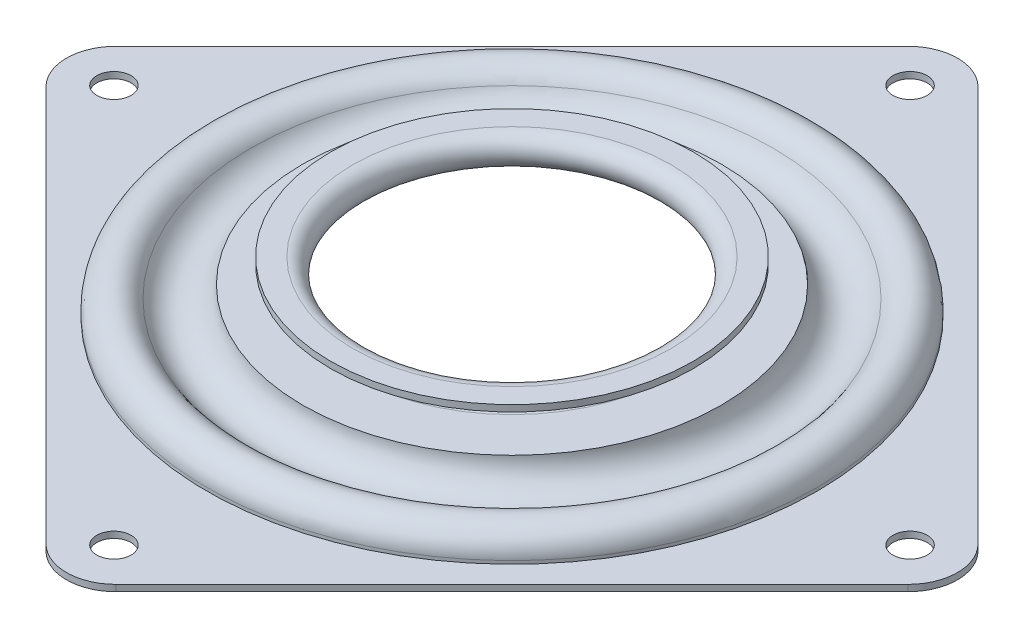
ISO-10303-21;
HEADER;
FILE_DESCRIPTION(('STEP AP214'),'2;1');
FILE_NAME('part.step','',(''),(''),'','','');
FILE_SCHEMA(('AUTOMOTIVE_DESIGN { 1 0 10303 214 1 1 1 1 }'));
ENDSEC;
DATA;
#1=APPLICATION_CONTEXT('core data for automotive mechanical design processes');
#2=APPLICATION_PROTOCOL_DEFINITION('international standard','automotive_design',2000,#1);
#3=PRODUCT_CONTEXT('',#1,'mechanical');
#4=PRODUCT('Part','Part','',(#3));
#5=PRODUCT_RELATED_PRODUCT_CATEGORY('part','',(#4));
#6=PRODUCT_DEFINITION_FORMATION('','',#4);
#7=PRODUCT_DEFINITION_CONTEXT('part definition',#1,'design');
#8=PRODUCT_DEFINITION('design','',#6,#7);
#9=PRODUCT_DEFINITION_SHAPE('','',#8);
#10=(LENGTH_UNIT() NAMED_UNIT(*) SI_UNIT(.MILLI.,.METRE.));
#11=(NAMED_UNIT(*) PLANE_ANGLE_UNIT() SI_UNIT($,.RADIAN.));
#12=(NAMED_UNIT(*) SI_UNIT($,.STERADIAN.) SOLID_ANGLE_UNIT());
#13=UNCERTAINTY_MEASURE_WITH_UNIT(LENGTH_MEASURE(1.E-05),#10,'distance_accuracy_value','');
#14=(GEOMETRIC_REPRESENTATION_CONTEXT(3) GLOBAL_UNCERTAINTY_ASSIGNED_CONTEXT((#13)) GLOBAL_UNIT_ASSIGNED_CONTEXT((#10,
#11,#12)) REPRESENTATION_CONTEXT('',''));
#15=CARTESIAN_POINT('',(0.,0.,0.));
#16=DIRECTION('',(0.,0.,1.));
#17=DIRECTION('',(1.,0.,0.));
#18=AXIS2_PLACEMENT_3D('',#15,#16,#17);
#19=CARTESIAN_POINT('',(18.40865,1.94055999999999,0.));
#20=DIRECTION('',(0.,1.,0.));
#21=DIRECTION('',(-1.,0.,0.));
#22=AXIS2_PLACEMENT_3D('',#19,#20,#21);
#23=PLANE('',#22);
#24=CARTESIAN_POINT('',(0.,1.94055999999999,0.));
#25=DIRECTION('',(0.,1.,0.));
#26=DIRECTION('',(-1.,0.,0.));
#27=AXIS2_PLACEMENT_3D('',#24,#25,#26);
#28=CIRCLE('',#27,20.9683035022425);
#29=CARTESIAN_POINT('',(-20.9683035022425,1.94055999999998,0.));
#30=VERTEX_POINT('',#29);
#31=EDGE_CURVE('E158',#30,#30,#28,.T.);
#32=ORIENTED_EDGE('',*,*,#31,.F.);
#33=EDGE_LOOP('',(#32));
#34=FACE_BOUND('',#33,.T.);
#35=CARTESIAN_POINT('',(0.,1.94055999999999,0.));
#36=DIRECTION('',(0.,1.,0.));
#37=DIRECTION('',(-1.,0.,0.));
#38=AXIS2_PLACEMENT_3D('',#35,#36,#37);
#39=CIRCLE('',#38,18.40865);
#40=CARTESIAN_POINT('',(-18.40865,1.94055999999998,0.));
#41=VERTEX_POINT('',#40);
#42=EDGE_CURVE('E123',#41,#41,#39,.T.);
#43=ORIENTED_EDGE('',*,*,#42,.T.);
#44=EDGE_LOOP('',(#43));
#45=FACE_BOUND('',#44,.T.);
#46=ADVANCED_FACE('F33',(#34,#45),#23,.F.);
#47=CARTESIAN_POINT('',(0.,0.905509999999988,0.));
#48=DIRECTION('',(0.,1.,0.));
#49=DIRECTION('',(-1.,0.,0.));
#50=AXIS2_PLACEMENT_3D('',#47,#48,#49);
#51=TOROIDAL_SURFACE('',#50,18.40865,1.03505);
#52=ORIENTED_EDGE('',*,*,#42,.F.);
#53=EDGE_LOOP('',(#52));
#54=FACE_BOUND('',#53,.T.);
#55=CARTESIAN_POINT('',(0.,-0.129540000000012,0.));
#56=DIRECTION('',(0.,1.,0.));
#57=DIRECTION('',(-1.,0.,0.));
#58=AXIS2_PLACEMENT_3D('',#55,#56,#57);
#59=CIRCLE('',#58,18.40865);
#60=CARTESIAN_POINT('',(-18.40865,-0.129540000000018,0.));
#61=VERTEX_POINT('',#60);
#62=EDGE_CURVE('E127',#61,#61,#59,.T.);
#63=ORIENTED_EDGE('',*,*,#62,.T.);
#64=EDGE_LOOP('',(#63));
#65=FACE_BOUND('',#64,.T.);
#66=ADVANCED_FACE('F208',(#54,#65),#51,.F.);
#67=CARTESIAN_POINT('',(23.5279570044849,-0.129540000000006,0.));
#68=DIRECTION('',(0.,-1.,0.));
#69=DIRECTION('',(1.,0.,0.));
#70=AXIS2_PLACEMENT_3D('',#67,#68,#69);
#71=PLANE('',#70);
#72=ORIENTED_EDGE('',*,*,#62,.F.);
#73=EDGE_LOOP('',(#72));
#74=FACE_BOUND('',#73,.T.);
#75=CARTESIAN_POINT('',(0.,-0.129540000000015,0.));
#76=DIRECTION('',(0.,1.,0.));
#77=DIRECTION('',(-1.,0.,0.));
#78=AXIS2_PLACEMENT_3D('',#75,#76,#77);
#79=CIRCLE('',#78,24.1707227175114);
#80=CARTESIAN_POINT('',(-24.1707227175114,-0.129540000000022,0.));
#81=VERTEX_POINT('',#80);
#82=EDGE_CURVE('E203',#81,#81,#79,.T.);
#83=ORIENTED_EDGE('',*,*,#82,.T.);
#84=EDGE_LOOP('',(#83));
#85=FACE_BOUND('',#84,.T.);
#86=ADVANCED_FACE('F210',(#74,#85),#71,.F.);
#87=CARTESIAN_POINT('',(0.,0.,0.));
#88=DIRECTION('',(0.,1.,0.));
#89=DIRECTION('',(-1.,0.,0.));
#90=AXIS2_PLACEMENT_3D('',#87,#88,#89);
#91=TOROIDAL_SURFACE('',#90,27.3685,3.20040000000001);
#92=ORIENTED_EDGE('',*,*,#82,.F.);
#93=EDGE_LOOP('',(#92));
#94=FACE_BOUND('',#93,.T.);
#95=CARTESIAN_POINT('',(0.,-1.53619200000002,0.));
#96=DIRECTION('',(0.,1.,0.));
#97=DIRECTION('',(-1.,0.,0.));
#98=AXIS2_PLACEMENT_3D('',#95,#96,#97);
#99=CIRCLE('',#98,30.1761100689262);
#100=CARTESIAN_POINT('',(-30.1761100689262,-1.53619200000003,0.));
#101=VERTEX_POINT('',#100);
#102=EDGE_CURVE('E200',#101,#101,#99,.T.);
#103=ORIENTED_EDGE('',*,*,#102,.T.);
#104=EDGE_LOOP('',(#103));
#105=FACE_BOUND('',#104,.T.);
#106=ADVANCED_FACE('F213',(#94,#105),#91,.F.);
#107=CARTESIAN_POINT('',(0.,-2.83464000000002,0.));
#108=DIRECTION('',(0.,1.,0.));
#109=DIRECTION('',(-1.,0.,0.));
#110=AXIS2_PLACEMENT_3D('',#107,#108,#109);
#111=TOROIDAL_SURFACE('',#110,32.5492090557568,2.70510000000001);
#112=ORIENTED_EDGE('',*,*,#102,.F.);
#113=EDGE_LOOP('',(#112));
#114=FACE_BOUND('',#113,.T.);
#115=CARTESIAN_POINT('',(0.,-2.83464000000002,0.));
#116=DIRECTION('',(0.,1.,0.));
#117=DIRECTION('',(-1.,0.,0.));
#118=AXIS2_PLACEMENT_3D('',#115,#116,#117);
#119=CIRCLE('',#118,35.2543090557568);
#120=CARTESIAN_POINT('',(-35.2543090557568,-2.83464000000003,0.));
#121=VERTEX_POINT('',#120);
#122=EDGE_CURVE('E197',#121,#121,#119,.T.);
#123=ORIENTED_EDGE('',*,*,#122,.T.);
#124=EDGE_LOOP('',(#123));
#125=FACE_BOUND('',#124,.T.);
#126=ADVANCED_FACE('F219',(#114,#125),#111,.T.);
#127=CARTESIAN_POINT('',(0.,3.93699999999999,0.));
#128=DIRECTION('',(0.,1.,0.));
#129=DIRECTION('',(-1.,0.,0.));
#130=AXIS2_PLACEMENT_3D('',#127,#128,#129);
#131=CYLINDRICAL_SURFACE('',#130,35.2543090557568);
#132=ORIENTED_EDGE('',*,*,#122,.F.);
#133=EDGE_LOOP('',(#132));
#134=FACE_BOUND('',#133,.T.);
#135=CARTESIAN_POINT('',(0.,-3.20040000000002,0.));
#136=DIRECTION('',(0.,1.,0.));
#137=DIRECTION('',(-1.,0.,0.));
#138=AXIS2_PLACEMENT_3D('',#135,#136,#137);
#139=CIRCLE('',#138,35.2543090557568);
#140=CARTESIAN_POINT('',(-35.2543090557568,-3.20040000000003,0.));
#141=VERTEX_POINT('',#140);
#142=EDGE_CURVE('E194',#141,#141,#139,.T.);
#143=ORIENTED_EDGE('',*,*,#142,.T.);
#144=EDGE_LOOP('',(#143));
#145=FACE_BOUND('',#144,.T.);
#146=ADVANCED_FACE('F225',(#134,#145),#131,.T.);
#147=CARTESIAN_POINT('',(38.1,-3.2004,0.));
#148=DIRECTION('',(0.,-1.,0.));
#149=DIRECTION('',(1.,0.,0.));
#150=AXIS2_PLACEMENT_3D('',#147,#148,#149);
#151=PLANE('',#150);
#152=CARTESIAN_POINT('',(46.0238126204794,-3.2004,0.));
#153=DIRECTION('',(0.,-1.,0.));
#154=DIRECTION('',(1.,0.,0.));
#155=AXIS2_PLACEMENT_3D('',#152,#153,#154);
#156=CIRCLE('',#155,1.984375);
#157=CARTESIAN_POINT('',(48.0081876204794,-3.2004,0.));
#158=VERTEX_POINT('',#157);
#159=EDGE_CURVE('E167',#158,#158,#156,.T.);
#160=ORIENTED_EDGE('',*,*,#159,.T.);
#161=EDGE_LOOP('',(#160));
#162=FACE_BOUND('',#161,.T.);
#163=CARTESIAN_POINT('',(0.,-3.20040000000001,-46.0238126204794));
#164=DIRECTION('',(0.,-1.,0.));
#165=DIRECTION('',(1.,0.,0.));
#166=AXIS2_PLACEMENT_3D('',#163,#164,#165);
#167=CIRCLE('',#166,1.984375);
#168=CARTESIAN_POINT('',(1.98437499999998,-3.20040000000001,-46.0238126204794));
#169=VERTEX_POINT('',#168);
#170=EDGE_CURVE('E363',#169,#169,#167,.T.);
#171=ORIENTED_EDGE('',*,*,#170,.T.);
#172=EDGE_LOOP('',(#171));
#173=FACE_BOUND('',#172,.T.);
#174=CARTESIAN_POINT('',(-46.0238126204794,-3.20040000000003,0.));
#175=DIRECTION('',(0.,-1.,0.));
#176=DIRECTION('',(1.,0.,0.));
#177=AXIS2_PLACEMENT_3D('',#174,#175,#176);
#178=CIRCLE('',#177,1.984375);
#179=CARTESIAN_POINT('',(-44.0394376204794,-3.20040000000003,0.));
#180=VERTEX_POINT('',#179);
#181=EDGE_CURVE('E360',#180,#180,#178,.T.);
#182=ORIENTED_EDGE('',*,*,#181,.T.);
#183=EDGE_LOOP('',(#182));
#184=FACE_BOUND('',#183,.T.);
#185=CARTESIAN_POINT('',(0.,-3.20040000000001,46.0238126204794));
#186=DIRECTION('',(0.,-1.,0.));
#187=DIRECTION('',(1.,0.,0.));
#188=AXIS2_PLACEMENT_3D('',#185,#186,#187);
#189=CIRCLE('',#188,1.984375);
#190=CARTESIAN_POINT('',(1.98437500000001,-3.20040000000001,46.0238126204794));
#191=VERTEX_POINT('',#190);
#192=EDGE_CURVE('E357',#191,#191,#189,.T.);
#193=ORIENTED_EDGE('',*,*,#192,.T.);
#194=EDGE_LOOP('',(#193));
#195=FACE_BOUND('',#194,.T.);
#196=ORIENTED_EDGE('',*,*,#142,.F.);
#197=EDGE_LOOP('',(#196));
#198=FACE_BOUND('',#197,.T.);
#199=DIRECTION('',(0.707106781186548,0.,-0.707106781186548));
#200=VECTOR('',#199,1.);
#201=CARTESIAN_POINT('',(0.,-3.2004,-53.8815367264149));
#202=LINE('',#201,#200);
#203=CARTESIAN_POINT('',(-49.8404214719338,-3.20040000000001,-4.04111525448109));
#204=VERTEX_POINT('',#203);
#205=CARTESIAN_POINT('',(-4.0411152544811,-3.2004,-49.8404214719338));
#206=VERTEX_POINT('',#205);
#207=EDGE_CURVE('E119',#204,#206,#202,.T.);
#208=ORIENTED_EDGE('',*,*,#207,.F.);
#209=CARTESIAN_POINT('',(-45.7993062174527,-3.20040000000003,0.));
#210=DIRECTION('',(0.,-1.,0.));
#211=DIRECTION('',(1.,0.,0.));
#212=AXIS2_PLACEMENT_3D('',#209,#210,#211);
#213=CIRCLE('',#212,5.715);
#214=CARTESIAN_POINT('',(-49.8404214719338,-3.20040000000001,4.04111525448111));
#215=VERTEX_POINT('',#214);
#216=EDGE_CURVE('E145',#204,#215,#213,.F.);
#217=ORIENTED_EDGE('',*,*,#216,.T.);
#218=DIRECTION('',(-0.707106781186548,0.,-0.707106781186548));
#219=VECTOR('',#218,1.);
#220=CARTESIAN_POINT('',(-53.8815367264149,-3.20040000000001,0.));
#221=LINE('',#220,#219);
#222=CARTESIAN_POINT('',(-4.04111525448108,-3.2004,49.8404214719338));
#223=VERTEX_POINT('',#222);
#224=EDGE_CURVE('E155',#223,#215,#221,.T.);
#225=ORIENTED_EDGE('',*,*,#224,.F.);
#226=CARTESIAN_POINT('',(0.,-3.20040000000001,45.7993062174527));
#227=DIRECTION('',(0.,-1.,0.));
#228=DIRECTION('',(1.,0.,0.));
#229=AXIS2_PLACEMENT_3D('',#226,#227,#228);
#230=CIRCLE('',#229,5.715);
#231=CARTESIAN_POINT('',(4.04111525448115,-3.20039999999999,49.8404214719338));
#232=VERTEX_POINT('',#231);
#233=EDGE_CURVE('E122',#223,#232,#230,.F.);
#234=ORIENTED_EDGE('',*,*,#233,.T.);
#235=DIRECTION('',(-0.707106781186548,0.,0.707106781186548));
#236=VECTOR('',#235,1.);
#237=CARTESIAN_POINT('',(0.,-3.2004,53.8815367264149));
#238=LINE('',#237,#236);
#239=CARTESIAN_POINT('',(49.8404214719339,-3.20039999999998,4.04111525448109));
#240=VERTEX_POINT('',#239);
#241=EDGE_CURVE('E154',#240,#232,#238,.T.);
#242=ORIENTED_EDGE('',*,*,#241,.F.);
#243=CARTESIAN_POINT('',(45.7993062174527,-3.2004,0.));
#244=DIRECTION('',(0.,-1.,0.));
#245=DIRECTION('',(1.,0.,0.));
#246=AXIS2_PLACEMENT_3D('',#243,#244,#245);
#247=CIRCLE('',#246,5.715);
#248=CARTESIAN_POINT('',(49.8404214719338,-3.20039999999998,-4.04111525448113));
#249=VERTEX_POINT('',#248);
#250=EDGE_CURVE('E48',#240,#249,#247,.F.);
#251=ORIENTED_EDGE('',*,*,#250,.T.);
#252=DIRECTION('',(0.707106781186548,0.,0.707106781186547));
#253=VECTOR('',#252,1.);
#254=CARTESIAN_POINT('',(53.881536726415,-3.20039999999998,0.));
#255=LINE('',#254,#253);
#256=CARTESIAN_POINT('',(4.04111525448113,-3.20039999999999,-49.8404214719338));
#257=VERTEX_POINT('',#256);
#258=EDGE_CURVE('E156',#257,#249,#255,.T.);
#259=ORIENTED_EDGE('',*,*,#258,.F.);
#260=CARTESIAN_POINT('',(0.,-3.20040000000001,-45.7993062174527));
#261=DIRECTION('',(0.,-1.,0.));
#262=DIRECTION('',(1.,0.,0.));
#263=AXIS2_PLACEMENT_3D('',#260,#261,#262);
#264=CIRCLE('',#263,5.715);
#265=EDGE_CURVE('E143',#257,#206,#264,.F.);
#266=ORIENTED_EDGE('',*,*,#265,.T.);
#267=EDGE_LOOP('',(#208,#217,#225,#234,#242,#251,#259,#266));
#268=FACE_BOUND('',#267,.T.);
#269=ADVANCED_FACE('F231',(#162,#173,#184,#195,#198,#268),#151,.F.);
#270=CARTESIAN_POINT('',(38.1,-3.937,0.));
#271=DIRECTION('',(0.,-1.,0.));
#272=DIRECTION('',(1.,0.,0.));
#273=AXIS2_PLACEMENT_3D('',#270,#271,#272);
#274=PLANE('',#273);
#275=CARTESIAN_POINT('',(46.0238126204794,-3.93700000000003,0.));
#276=DIRECTION('',(0.,1.,0.));
#277=DIRECTION('',(0.,0.,1.));
#278=AXIS2_PLACEMENT_3D('',#275,#276,#277);
#279=CIRCLE('',#278,1.984375);
#280=CARTESIAN_POINT('',(46.0238126204794,-3.93700000000003,1.98437499999999));
#281=VERTEX_POINT('',#280);
#282=EDGE_CURVE('E338',#281,#281,#279,.T.);
#283=ORIENTED_EDGE('',*,*,#282,.T.);
#284=EDGE_LOOP('',(#283));
#285=FACE_BOUND('',#284,.T.);
#286=CARTESIAN_POINT('',(0.,-3.93700000000003,-46.0238126204794));
#287=DIRECTION('',(0.,1.,0.));
#288=DIRECTION('',(0.,0.,1.));
#289=AXIS2_PLACEMENT_3D('',#286,#287,#288);
#290=CIRCLE('',#289,1.984375);
#291=CARTESIAN_POINT('',(0.,-3.93700000000003,-44.0394376204794));
#292=VERTEX_POINT('',#291);
#293=EDGE_CURVE('E342',#292,#292,#290,.T.);
#294=ORIENTED_EDGE('',*,*,#293,.T.);
#295=EDGE_LOOP('',(#294));
#296=FACE_BOUND('',#295,.T.);
#297=CARTESIAN_POINT('',(-46.0238126204794,-3.93700000000003,0.));
#298=DIRECTION('',(0.,1.,0.));
#299=DIRECTION('',(0.,0.,1.));
#300=AXIS2_PLACEMENT_3D('',#297,#298,#299);
#301=CIRCLE('',#300,1.984375);
#302=CARTESIAN_POINT('',(-46.0238126204794,-3.93700000000003,1.98437500000001));
#303=VERTEX_POINT('',#302);
#304=EDGE_CURVE('E346',#303,#303,#301,.T.);
#305=ORIENTED_EDGE('',*,*,#304,.T.);
#306=EDGE_LOOP('',(#305));
#307=FACE_BOUND('',#306,.T.);
#308=CARTESIAN_POINT('',(0.,-3.93700000000003,46.0238126204794));
#309=DIRECTION('',(0.,1.,0.));
#310=DIRECTION('',(0.,0.,1.));
#311=AXIS2_PLACEMENT_3D('',#308,#309,#310);
#312=CIRCLE('',#311,1.984375);
#313=CARTESIAN_POINT('',(0.,-3.93700000000003,48.0081876204794));
#314=VERTEX_POINT('',#313);
#315=EDGE_CURVE('E350',#314,#314,#312,.T.);
#316=ORIENTED_EDGE('',*,*,#315,.T.);
#317=EDGE_LOOP('',(#316));
#318=FACE_BOUND('',#317,.T.);
#319=CARTESIAN_POINT('',(0.,-3.93700000000002,0.));
#320=DIRECTION('',(0.,1.,0.));
#321=DIRECTION('',(-1.,0.,0.));
#322=AXIS2_PLACEMENT_3D('',#319,#320,#321);
#323=CIRCLE('',#322,34.5177090557568);
#324=CARTESIAN_POINT('',(-34.5177090557568,-3.93700000000003,0.));
#325=VERTEX_POINT('',#324);
#326=EDGE_CURVE('E191',#325,#325,#323,.T.);
#327=ORIENTED_EDGE('',*,*,#326,.T.);
#328=EDGE_LOOP('',(#327));
#329=FACE_BOUND('',#328,.T.);
#330=DIRECTION('',(-0.707106781186548,0.,-0.707106781186548));
#331=VECTOR('',#330,1.);
#332=CARTESIAN_POINT('',(-53.8815367264149,-3.93700000000003,0.));
#333=LINE('',#332,#331);
#334=CARTESIAN_POINT('',(-4.04111525448108,-3.93700000000001,49.8404214719338));
#335=VERTEX_POINT('',#334);
#336=CARTESIAN_POINT('',(-49.8404214719338,-3.93700000000003,4.04111525448111));
#337=VERTEX_POINT('',#336);
#338=EDGE_CURVE('E102',#335,#337,#333,.T.);
#339=ORIENTED_EDGE('',*,*,#338,.T.);
#340=CARTESIAN_POINT('',(-45.7993062174527,-3.93700000000003,0.));
#341=DIRECTION('',(0.,-1.,0.));
#342=DIRECTION('',(1.,0.,0.));
#343=AXIS2_PLACEMENT_3D('',#340,#341,#342);
#344=CIRCLE('',#343,5.715);
#345=CARTESIAN_POINT('',(-49.8404214719338,-3.93700000000003,-4.04111525448109));
#346=VERTEX_POINT('',#345);
#347=EDGE_CURVE('E134',#337,#346,#344,.T.);
#348=ORIENTED_EDGE('',*,*,#347,.T.);
#349=DIRECTION('',(0.707106781186548,0.,-0.707106781186548));
#350=VECTOR('',#349,1.);
#351=CARTESIAN_POINT('',(0.,-3.93700000000001,-53.8815367264149));
#352=LINE('',#351,#350);
#353=CARTESIAN_POINT('',(-4.0411152544811,-3.93700000000001,-49.8404214719338));
#354=VERTEX_POINT('',#353);
#355=EDGE_CURVE('E163',#346,#354,#352,.T.);
#356=ORIENTED_EDGE('',*,*,#355,.T.);
#357=CARTESIAN_POINT('',(0.,-3.93700000000001,-45.7993062174527));
#358=DIRECTION('',(0.,-1.,0.));
#359=DIRECTION('',(1.,0.,0.));
#360=AXIS2_PLACEMENT_3D('',#357,#358,#359);
#361=CIRCLE('',#360,5.715);
#362=CARTESIAN_POINT('',(4.04111525448113,-3.93700000000001,-49.8404214719338));
#363=VERTEX_POINT('',#362);
#364=EDGE_CURVE('E132',#354,#363,#361,.T.);
#365=ORIENTED_EDGE('',*,*,#364,.T.);
#366=DIRECTION('',(0.707106781186548,0.,0.707106781186547));
#367=VECTOR('',#366,1.);
#368=CARTESIAN_POINT('',(53.881536726415,-3.937,0.));
#369=LINE('',#368,#367);
#370=CARTESIAN_POINT('',(49.8404214719338,-3.937,-4.04111525448113));
#371=VERTEX_POINT('',#370);
#372=EDGE_CURVE('E166',#363,#371,#369,.T.);
#373=ORIENTED_EDGE('',*,*,#372,.T.);
#374=CARTESIAN_POINT('',(45.7993062174527,-3.937,0.));
#375=DIRECTION('',(0.,-1.,0.));
#376=DIRECTION('',(1.,0.,0.));
#377=AXIS2_PLACEMENT_3D('',#374,#375,#376);
#378=CIRCLE('',#377,5.715);
#379=CARTESIAN_POINT('',(49.8404214719339,-3.937,4.04111525448109));
#380=VERTEX_POINT('',#379);
#381=EDGE_CURVE('E109',#371,#380,#378,.T.);
#382=ORIENTED_EDGE('',*,*,#381,.T.);
#383=DIRECTION('',(-0.707106781186548,0.,0.707106781186548));
#384=VECTOR('',#383,1.);
#385=CARTESIAN_POINT('',(0.,-3.93700000000001,53.8815367264149));
#386=LINE('',#385,#384);
#387=CARTESIAN_POINT('',(4.04111525448115,-3.93700000000001,49.8404214719338));
#388=VERTEX_POINT('',#387);
#389=EDGE_CURVE('E104',#380,#388,#386,.T.);
#390=ORIENTED_EDGE('',*,*,#389,.T.);
#391=CARTESIAN_POINT('',(0.,-3.93700000000001,45.7993062174527));
#392=DIRECTION('',(0.,-1.,0.));
#393=DIRECTION('',(1.,0.,0.));
#394=AXIS2_PLACEMENT_3D('',#391,#392,#393);
#395=CIRCLE('',#394,5.715);
#396=EDGE_CURVE('E99',#388,#335,#395,.T.);
#397=ORIENTED_EDGE('',*,*,#396,.T.);
#398=EDGE_LOOP('',(#339,#348,#356,#365,#373,#382,#390,#397));
#399=FACE_BOUND('',#398,.T.);
#400=ADVANCED_FACE('F101',(#285,#296,#307,#318,#329,#399),#274,.T.);
#401=CARTESIAN_POINT('',(0.,3.93699999999999,0.));
#402=DIRECTION('',(0.,1.,0.));
#403=DIRECTION('',(-1.,0.,0.));
#404=AXIS2_PLACEMENT_3D('',#401,#402,#403);
#405=CYLINDRICAL_SURFACE('',#404,34.5177090557568);
#406=CARTESIAN_POINT('',(0.,-2.83464000000002,0.));
#407=DIRECTION('',(0.,1.,0.));
#408=DIRECTION('',(-1.,0.,0.));
#409=AXIS2_PLACEMENT_3D('',#406,#407,#408);
#410=CIRCLE('',#409,34.5177090557568);
#411=CARTESIAN_POINT('',(-34.5177090557568,-2.83464000000003,0.));
#412=VERTEX_POINT('',#411);
#413=EDGE_CURVE('E188',#412,#412,#410,.T.);
#414=ORIENTED_EDGE('',*,*,#413,.T.);
#415=EDGE_LOOP('',(#414));
#416=FACE_BOUND('',#415,.T.);
#417=ORIENTED_EDGE('',*,*,#326,.F.);
#418=EDGE_LOOP('',(#417));
#419=FACE_BOUND('',#418,.T.);
#420=ADVANCED_FACE('F327',(#416,#419),#405,.F.);
#421=CARTESIAN_POINT('',(0.,-2.83464000000002,0.));
#422=DIRECTION('',(0.,1.,0.));
#423=DIRECTION('',(-1.,0.,0.));
#424=AXIS2_PLACEMENT_3D('',#421,#422,#423);
#425=TOROIDAL_SURFACE('',#424,32.5492090557568,1.96850000000001);
#426=CARTESIAN_POINT('',(0.,-1.88976000000002,0.));
#427=DIRECTION('',(0.,1.,0.));
#428=DIRECTION('',(-1.,0.,0.));
#429=AXIS2_PLACEMENT_3D('',#426,#427,#428);
#430=CIRCLE('',#429,30.8223060371712);
#431=CARTESIAN_POINT('',(-30.8223060371712,-1.88976000000003,0.));
#432=VERTEX_POINT('',#431);
#433=EDGE_CURVE('E185',#432,#432,#430,.T.);
#434=ORIENTED_EDGE('',*,*,#433,.T.);
#435=EDGE_LOOP('',(#434));
#436=FACE_BOUND('',#435,.T.);
#437=ORIENTED_EDGE('',*,*,#413,.F.);
#438=EDGE_LOOP('',(#437));
#439=FACE_BOUND('',#438,.T.);
#440=ADVANCED_FACE('F323',(#436,#439),#425,.F.);
#441=CARTESIAN_POINT('',(0.,0.,0.));
#442=DIRECTION('',(0.,1.,0.));
#443=DIRECTION('',(-1.,0.,0.));
#444=AXIS2_PLACEMENT_3D('',#441,#442,#443);
#445=TOROIDAL_SURFACE('',#444,27.3685,3.93700000000001);
#446=CARTESIAN_POINT('',(0.,-0.866140000000013,0.));
#447=DIRECTION('',(0.,1.,0.));
#448=DIRECTION('',(-1.,0.,0.));
#449=AXIS2_PLACEMENT_3D('',#446,#447,#448);
#450=CIRCLE('',#449,23.5279570044849);
#451=CARTESIAN_POINT('',(-23.5279570044849,-0.866140000000021,0.));
#452=VERTEX_POINT('',#451);
#453=EDGE_CURVE('E182',#452,#452,#450,.T.);
#454=ORIENTED_EDGE('',*,*,#453,.T.);
#455=EDGE_LOOP('',(#454));
#456=FACE_BOUND('',#455,.T.);
#457=ORIENTED_EDGE('',*,*,#433,.F.);
#458=EDGE_LOOP('',(#457));
#459=FACE_BOUND('',#458,.T.);
#460=ADVANCED_FACE('F319',(#456,#459),#445,.T.);
#461=CARTESIAN_POINT('',(23.5279570044849,-0.866140000000006,0.));
#462=DIRECTION('',(0.,-1.,0.));
#463=DIRECTION('',(1.,0.,0.));
#464=AXIS2_PLACEMENT_3D('',#461,#462,#463);
#465=PLANE('',#464);
#466=CARTESIAN_POINT('',(0.,-0.866140000000012,0.));
#467=DIRECTION('',(0.,1.,0.));
#468=DIRECTION('',(-1.,0.,0.));
#469=AXIS2_PLACEMENT_3D('',#466,#467,#468);
#470=CIRCLE('',#469,18.40865);
#471=CARTESIAN_POINT('',(-18.40865,-0.866140000000017,0.));
#472=VERTEX_POINT('',#471);
#473=EDGE_CURVE('E179',#472,#472,#470,.T.);
#474=ORIENTED_EDGE('',*,*,#473,.T.);
#475=EDGE_LOOP('',(#474));
#476=FACE_BOUND('',#475,.T.);
#477=ORIENTED_EDGE('',*,*,#453,.F.);
#478=EDGE_LOOP('',(#477));
#479=FACE_BOUND('',#478,.T.);
#480=ADVANCED_FACE('F315',(#476,#479),#465,.T.);
#481=CARTESIAN_POINT('',(0.,0.905509999999988,0.));
#482=DIRECTION('',(0.,1.,0.));
#483=DIRECTION('',(-1.,0.,0.));
#484=AXIS2_PLACEMENT_3D('',#481,#482,#483);
#485=TOROIDAL_SURFACE('',#484,18.40865,1.77165);
#486=CARTESIAN_POINT('',(0.,2.67715999999999,0.));
#487=DIRECTION('',(0.,1.,0.));
#488=DIRECTION('',(-1.,0.,0.));
#489=AXIS2_PLACEMENT_3D('',#486,#487,#488);
#490=CIRCLE('',#489,18.40865);
#491=CARTESIAN_POINT('',(-18.40865,2.67715999999998,0.));
#492=VERTEX_POINT('',#491);
#493=EDGE_CURVE('E176',#492,#492,#490,.T.);
#494=ORIENTED_EDGE('',*,*,#493,.T.);
#495=EDGE_LOOP('',(#494));
#496=FACE_BOUND('',#495,.T.);
#497=ORIENTED_EDGE('',*,*,#473,.F.);
#498=EDGE_LOOP('',(#497));
#499=FACE_BOUND('',#498,.T.);
#500=ADVANCED_FACE('F311',(#496,#499),#485,.T.);
#501=CARTESIAN_POINT('',(18.40865,2.67715999999999,0.));
#502=DIRECTION('',(0.,1.,0.));
#503=DIRECTION('',(-1.,0.,0.));
#504=AXIS2_PLACEMENT_3D('',#501,#502,#503);
#505=PLANE('',#504);
#506=CARTESIAN_POINT('',(0.,2.67715999999999,0.));
#507=DIRECTION('',(0.,1.,0.));
#508=DIRECTION('',(-1.,0.,0.));
#509=AXIS2_PLACEMENT_3D('',#506,#507,#508);
#510=CIRCLE('',#509,20.9683035022425);
#511=CARTESIAN_POINT('',(-20.9683035022425,2.67715999999998,0.));
#512=VERTEX_POINT('',#511);
#513=EDGE_CURVE('E173',#512,#512,#510,.T.);
#514=ORIENTED_EDGE('',*,*,#513,.T.);
#515=EDGE_LOOP('',(#514));
#516=FACE_BOUND('',#515,.T.);
#517=ORIENTED_EDGE('',*,*,#493,.F.);
#518=EDGE_LOOP('',(#517));
#519=FACE_BOUND('',#518,.T.);
#520=ADVANCED_FACE('F307',(#516,#519),#505,.T.);
#521=CARTESIAN_POINT('',(0.,3.93699999999999,0.));
#522=DIRECTION('',(0.,1.,0.));
#523=DIRECTION('',(-1.,0.,0.));
#524=AXIS2_PLACEMENT_3D('',#521,#522,#523);
#525=CYLINDRICAL_SURFACE('',#524,20.9683035022425);
#526=ORIENTED_EDGE('',*,*,#31,.T.);
#527=EDGE_LOOP('',(#526));
#528=FACE_BOUND('',#527,.T.);
#529=ORIENTED_EDGE('',*,*,#513,.F.);
#530=EDGE_LOOP('',(#529));
#531=FACE_BOUND('',#530,.T.);
#532=ADVANCED_FACE('F304',(#528,#531),#525,.T.);
#533=CARTESIAN_POINT('',(0.,-3.2004,-53.8815367264149));
#534=DIRECTION('',(-0.707106781186547,0.,-0.707106781186547));
#535=DIRECTION('',(-0.707106781186548,0.,0.707106781186548));
#536=AXIS2_PLACEMENT_3D('',#533,#534,#535);
#537=PLANE('',#536);
#538=ORIENTED_EDGE('',*,*,#355,.F.);
#539=DIRECTION('',(0.,-1.,0.));
#540=VECTOR('',#539,1.);
#541=CARTESIAN_POINT('',(-49.8404214719338,-3.20040000000001,-4.04111525448112));
#542=LINE('',#541,#540);
#543=EDGE_CURVE('E139',#346,#204,#542,.F.);
#544=ORIENTED_EDGE('',*,*,#543,.T.);
#545=ORIENTED_EDGE('',*,*,#207,.T.);
#546=DIRECTION('',(0.,-1.,0.));
#547=VECTOR('',#546,1.);
#548=CARTESIAN_POINT('',(-4.04111525448109,-3.2004,-49.8404214719338));
#549=LINE('',#548,#547);
#550=EDGE_CURVE('E136',#206,#354,#549,.T.);
#551=ORIENTED_EDGE('',*,*,#550,.T.);
#552=EDGE_LOOP('',(#538,#544,#545,#551));
#553=FACE_BOUND('',#552,.T.);
#554=ADVANCED_FACE('F248',(#553),#537,.T.);
#555=CARTESIAN_POINT('',(-53.8815367264149,-3.20040000000001,0.));
#556=DIRECTION('',(-0.707106781186547,0.,0.707106781186547));
#557=DIRECTION('',(0.707106781186548,0.,0.707106781186548));
#558=AXIS2_PLACEMENT_3D('',#555,#556,#557);
#559=PLANE('',#558);
#560=ORIENTED_EDGE('',*,*,#224,.T.);
#561=DIRECTION('',(0.,-1.,0.));
#562=VECTOR('',#561,1.);
#563=CARTESIAN_POINT('',(-49.8404214719338,-3.20040000000001,4.04111525448111));
#564=LINE('',#563,#562);
#565=EDGE_CURVE('E110',#215,#337,#564,.T.);
#566=ORIENTED_EDGE('',*,*,#565,.T.);
#567=ORIENTED_EDGE('',*,*,#338,.F.);
#568=DIRECTION('',(0.,-1.,0.));
#569=VECTOR('',#568,1.);
#570=CARTESIAN_POINT('',(-4.0411152544811,-3.2004,49.8404214719338));
#571=LINE('',#570,#569);
#572=EDGE_CURVE('E116',#335,#223,#571,.F.);
#573=ORIENTED_EDGE('',*,*,#572,.T.);
#574=EDGE_LOOP('',(#560,#566,#567,#573));
#575=FACE_BOUND('',#574,.T.);
#576=ADVANCED_FACE('F115',(#575),#559,.T.);
#577=CARTESIAN_POINT('',(0.,-3.2004,53.8815367264149));
#578=DIRECTION('',(0.707106781186547,0.,0.707106781186547));
#579=DIRECTION('',(0.707106781186548,0.,-0.707106781186548));
#580=AXIS2_PLACEMENT_3D('',#577,#578,#579);
#581=PLANE('',#580);
#582=ORIENTED_EDGE('',*,*,#389,.F.);
#583=DIRECTION('',(0.,-1.,0.));
#584=VECTOR('',#583,1.);
#585=CARTESIAN_POINT('',(49.8404214719338,-3.20039999999998,4.04111525448112));
#586=LINE('',#585,#584);
#587=EDGE_CURVE('E11',#380,#240,#586,.F.);
#588=ORIENTED_EDGE('',*,*,#587,.T.);
#589=ORIENTED_EDGE('',*,*,#241,.T.);
#590=DIRECTION('',(0.,-1.,0.));
#591=VECTOR('',#590,1.);
#592=CARTESIAN_POINT('',(4.04111525448115,-3.20039999999999,49.8404214719338));
#593=LINE('',#592,#591);
#594=EDGE_CURVE('E41',#232,#388,#593,.T.);
#595=ORIENTED_EDGE('',*,*,#594,.T.);
#596=EDGE_LOOP('',(#582,#588,#589,#595));
#597=FACE_BOUND('',#596,.T.);
#598=ADVANCED_FACE('F152',(#597),#581,.T.);
#599=CARTESIAN_POINT('',(53.881536726415,-3.20039999999998,0.));
#600=DIRECTION('',(0.707106781186547,0.,-0.707106781186548));
#601=DIRECTION('',(-0.707106781186548,0.,-0.707106781186547));
#602=AXIS2_PLACEMENT_3D('',#599,#600,#601);
#603=PLANE('',#602);
#604=ORIENTED_EDGE('',*,*,#372,.F.);
#605=DIRECTION('',(0.,-1.,0.));
#606=VECTOR('',#605,1.);
#607=CARTESIAN_POINT('',(4.04111525448113,-3.20039999999999,-49.8404214719338));
#608=LINE('',#607,#606);
#609=EDGE_CURVE('E55',#363,#257,#608,.F.);
#610=ORIENTED_EDGE('',*,*,#609,.T.);
#611=ORIENTED_EDGE('',*,*,#258,.T.);
#612=DIRECTION('',(0.,-1.,0.));
#613=VECTOR('',#612,1.);
#614=CARTESIAN_POINT('',(49.8404214719338,-3.20039999999998,-4.04111525448113));
#615=LINE('',#614,#613);
#616=EDGE_CURVE('E147',#249,#371,#615,.T.);
#617=ORIENTED_EDGE('',*,*,#616,.T.);
#618=EDGE_LOOP('',(#604,#610,#611,#617));
#619=FACE_BOUND('',#618,.T.);
#620=ADVANCED_FACE('F251',(#619),#603,.T.);
#621=CARTESIAN_POINT('',(0.,-3.93700000000003,46.0238126204794));
#622=DIRECTION('',(0.,1.,0.));
#623=DIRECTION('',(0.,0.,1.));
#624=AXIS2_PLACEMENT_3D('',#621,#622,#623);
#625=CYLINDRICAL_SURFACE('',#624,1.984375);
#626=ORIENTED_EDGE('',*,*,#315,.F.);
#627=EDGE_LOOP('',(#626));
#628=FACE_BOUND('',#627,.T.);
#629=ORIENTED_EDGE('',*,*,#192,.F.);
#630=EDGE_LOOP('',(#629));
#631=FACE_BOUND('',#630,.T.);
#632=ADVANCED_FACE('F291',(#628,#631),#625,.F.);
#633=CARTESIAN_POINT('',(-46.0238126204794,-3.93700000000003,0.));
#634=DIRECTION('',(0.,1.,0.));
#635=DIRECTION('',(0.,0.,1.));
#636=AXIS2_PLACEMENT_3D('',#633,#634,#635);
#637=CYLINDRICAL_SURFACE('',#636,1.984375);
#638=ORIENTED_EDGE('',*,*,#304,.F.);
#639=EDGE_LOOP('',(#638));
#640=FACE_BOUND('',#639,.T.);
#641=ORIENTED_EDGE('',*,*,#181,.F.);
#642=EDGE_LOOP('',(#641));
#643=FACE_BOUND('',#642,.T.);
#644=ADVANCED_FACE('F283',(#640,#643),#637,.F.);
#645=CARTESIAN_POINT('',(0.,-3.93700000000003,-46.0238126204794));
#646=DIRECTION('',(0.,1.,0.));
#647=DIRECTION('',(0.,0.,1.));
#648=AXIS2_PLACEMENT_3D('',#645,#646,#647);
#649=CYLINDRICAL_SURFACE('',#648,1.984375);
#650=ORIENTED_EDGE('',*,*,#293,.F.);
#651=EDGE_LOOP('',(#650));
#652=FACE_BOUND('',#651,.T.);
#653=ORIENTED_EDGE('',*,*,#170,.F.);
#654=EDGE_LOOP('',(#653));
#655=FACE_BOUND('',#654,.T.);
#656=ADVANCED_FACE('F277',(#652,#655),#649,.F.);
#657=CARTESIAN_POINT('',(46.0238126204794,-3.93700000000003,0.));
#658=DIRECTION('',(0.,1.,0.));
#659=DIRECTION('',(0.,0.,1.));
#660=AXIS2_PLACEMENT_3D('',#657,#658,#659);
#661=CYLINDRICAL_SURFACE('',#660,1.984375);
#662=ORIENTED_EDGE('',*,*,#282,.F.);
#663=EDGE_LOOP('',(#662));
#664=FACE_BOUND('',#663,.T.);
#665=ORIENTED_EDGE('',*,*,#159,.F.);
#666=EDGE_LOOP('',(#665));
#667=FACE_BOUND('',#666,.T.);
#668=ADVANCED_FACE('F273',(#664,#667),#661,.F.);
#669=CARTESIAN_POINT('',(-45.7993062174527,-3.20040000000001,0.));
#670=DIRECTION('',(0.,-1.,0.));
#671=DIRECTION('',(1.,0.,0.));
#672=AXIS2_PLACEMENT_3D('',#669,#670,#671);
#673=CYLINDRICAL_SURFACE('',#672,5.715);
#674=ORIENTED_EDGE('',*,*,#216,.F.);
#675=ORIENTED_EDGE('',*,*,#543,.F.);
#676=ORIENTED_EDGE('',*,*,#347,.F.);
#677=ORIENTED_EDGE('',*,*,#565,.F.);
#678=EDGE_LOOP('',(#674,#675,#676,#677));
#679=FACE_BOUND('',#678,.T.);
#680=ADVANCED_FACE('F246',(#679),#673,.T.);
#681=CARTESIAN_POINT('',(0.,-3.2004,-45.7993062174527));
#682=DIRECTION('',(0.,-1.,0.));
#683=DIRECTION('',(1.,0.,0.));
#684=AXIS2_PLACEMENT_3D('',#681,#682,#683);
#685=CYLINDRICAL_SURFACE('',#684,5.715);
#686=ORIENTED_EDGE('',*,*,#265,.F.);
#687=ORIENTED_EDGE('',*,*,#609,.F.);
#688=ORIENTED_EDGE('',*,*,#364,.F.);
#689=ORIENTED_EDGE('',*,*,#550,.F.);
#690=EDGE_LOOP('',(#686,#687,#688,#689));
#691=FACE_BOUND('',#690,.T.);
#692=ADVANCED_FACE('F250',(#691),#685,.T.);
#693=CARTESIAN_POINT('',(45.7993062174527,-3.20039999999998,0.));
#694=DIRECTION('',(0.,-1.,0.));
#695=DIRECTION('',(1.,0.,0.));
#696=AXIS2_PLACEMENT_3D('',#693,#694,#695);
#697=CYLINDRICAL_SURFACE('',#696,5.715);
#698=ORIENTED_EDGE('',*,*,#250,.F.);
#699=ORIENTED_EDGE('',*,*,#587,.F.);
#700=ORIENTED_EDGE('',*,*,#381,.F.);
#701=ORIENTED_EDGE('',*,*,#616,.F.);
#702=EDGE_LOOP('',(#698,#699,#700,#701));
#703=FACE_BOUND('',#702,.T.);
#704=ADVANCED_FACE('F254',(#703),#697,.T.);
#705=CARTESIAN_POINT('',(0.,-3.2004,45.7993062174527));
#706=DIRECTION('',(0.,-1.,0.));
#707=DIRECTION('',(1.,0.,0.));
#708=AXIS2_PLACEMENT_3D('',#705,#706,#707);
#709=CYLINDRICAL_SURFACE('',#708,5.715);
#710=ORIENTED_EDGE('',*,*,#233,.F.);
#711=ORIENTED_EDGE('',*,*,#572,.F.);
#712=ORIENTED_EDGE('',*,*,#396,.F.);
#713=ORIENTED_EDGE('',*,*,#594,.F.);
#714=EDGE_LOOP('',(#710,#711,#712,#713));
#715=FACE_BOUND('',#714,.T.);
#716=ADVANCED_FACE('F35',(#715),#709,.T.);
#717=CLOSED_SHELL('',(#46,#66,#86,#106,#126,#146,#269,#400,#420,#440,#460,#480,#500,#520,#532,
#554,#576,#598,#620,#632,#644,#656,#668,#680,#692,#704,#716));
#718=MANIFOLD_SOLID_BREP('B2',#717);
#719=ADVANCED_BREP_SHAPE_REPRESENTATION('',(#18,#718),#14);
#720=SHAPE_DEFINITION_REPRESENTATION(#9,#719);
ENDSEC;
END-ISO-10303-21;
